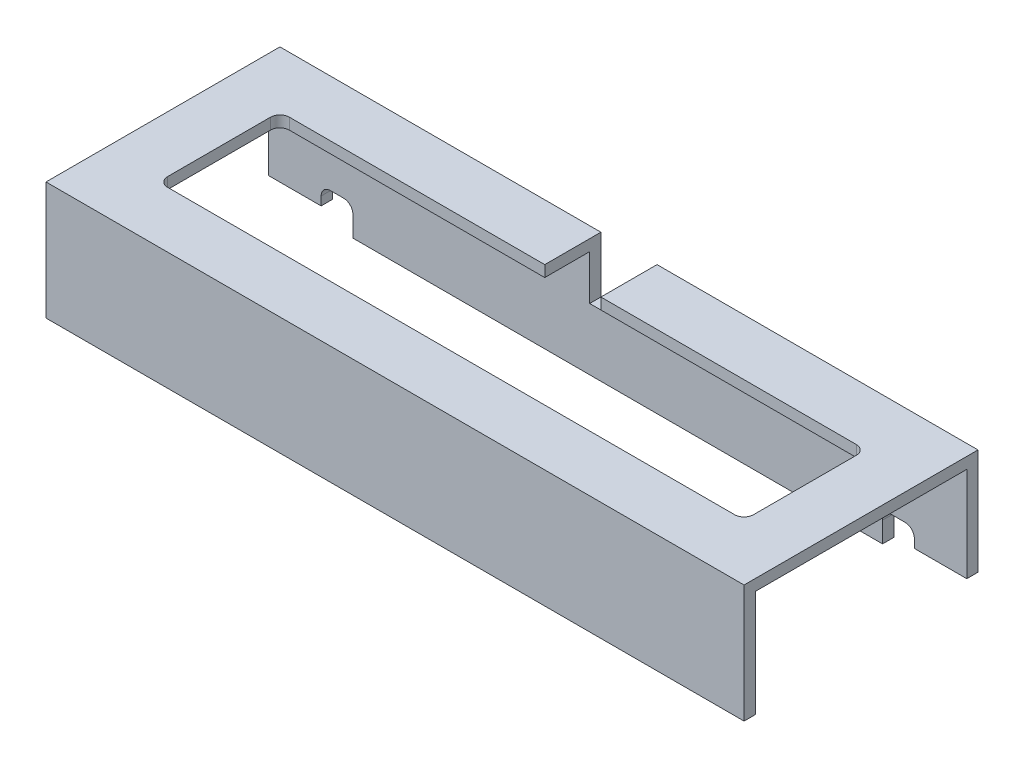
ISO-10303-21;
HEADER;
FILE_DESCRIPTION(('STEP AP214'),'2;1');
FILE_NAME('part.step','',(''),(''),'','','');
FILE_SCHEMA(('AUTOMOTIVE_DESIGN { 1 0 10303 214 1 1 1 1 }'));
ENDSEC;
DATA;
#1=APPLICATION_CONTEXT('core data for automotive mechanical design processes');
#2=APPLICATION_PROTOCOL_DEFINITION('international standard','automotive_design',2000,#1);
#3=PRODUCT_CONTEXT('',#1,'mechanical');
#4=PRODUCT('Part','Part','',(#3));
#5=PRODUCT_RELATED_PRODUCT_CATEGORY('part','',(#4));
#6=PRODUCT_DEFINITION_FORMATION('','',#4);
#7=PRODUCT_DEFINITION_CONTEXT('part definition',#1,'design');
#8=PRODUCT_DEFINITION('design','',#6,#7);
#9=PRODUCT_DEFINITION_SHAPE('','',#8);
#10=(LENGTH_UNIT() NAMED_UNIT(*) SI_UNIT(.MILLI.,.METRE.));
#11=(NAMED_UNIT(*) PLANE_ANGLE_UNIT() SI_UNIT($,.RADIAN.));
#12=(NAMED_UNIT(*) SI_UNIT($,.STERADIAN.) SOLID_ANGLE_UNIT());
#13=UNCERTAINTY_MEASURE_WITH_UNIT(LENGTH_MEASURE(1.E-05),#10,'distance_accuracy_value','');
#14=(GEOMETRIC_REPRESENTATION_CONTEXT(3) GLOBAL_UNCERTAINTY_ASSIGNED_CONTEXT((#13)) GLOBAL_UNIT_ASSIGNED_CONTEXT((#10,
#11,#12)) REPRESENTATION_CONTEXT('',''));
#15=CARTESIAN_POINT('',(0.,0.,0.));
#16=DIRECTION('',(0.,0.,1.));
#17=DIRECTION('',(1.,0.,0.));
#18=AXIS2_PLACEMENT_3D('',#15,#16,#17);
#19=CARTESIAN_POINT('',(451.478569788377,63.,-125.));
#20=DIRECTION('',(0.,-1.,0.));
#21=DIRECTION('',(0.,0.,-1.));
#22=AXIS2_PLACEMENT_3D('',#19,#20,#21);
#23=PLANE('',#22);
#24=DIRECTION('',(1.,0.,0.));
#25=VECTOR('',#24,1.);
#26=CARTESIAN_POINT('',(0.,63.,-95.));
#27=LINE('',#26,#25);
#28=CARTESIAN_POINT('',(139.999999999998,63.,-95.));
#29=VERTEX_POINT('',#28);
#30=CARTESIAN_POINT('',(276.499999999998,63.,-95.));
#31=VERTEX_POINT('',#30);
#32=EDGE_CURVE('E281',#29,#31,#27,.T.);
#33=ORIENTED_EDGE('',*,*,#32,.T.);
#34=CARTESIAN_POINT('',(276.499999999998,63.,-90.));
#35=DIRECTION('',(0.,-1.,0.));
#36=DIRECTION('',(0.,0.,-1.));
#37=AXIS2_PLACEMENT_3D('',#34,#35,#36);
#38=CIRCLE('',#37,5.);
#39=CARTESIAN_POINT('',(281.499999999998,63.,-90.));
#40=VERTEX_POINT('',#39);
#41=EDGE_CURVE('E375',#31,#40,#38,.T.);
#42=ORIENTED_EDGE('',*,*,#41,.T.);
#43=DIRECTION('',(0.,0.,-1.));
#44=VECTOR('',#43,1.);
#45=CARTESIAN_POINT('',(281.499999999998,63.,0.));
#46=LINE('',#45,#44);
#47=CARTESIAN_POINT('',(281.499999999998,63.,-35.));
#48=VERTEX_POINT('',#47);
#49=EDGE_CURVE('E408',#48,#40,#46,.T.);
#50=ORIENTED_EDGE('',*,*,#49,.F.);
#51=CARTESIAN_POINT('',(276.499999999998,63.,-35.));
#52=DIRECTION('',(0.,-1.,0.));
#53=DIRECTION('',(0.,0.,-1.));
#54=AXIS2_PLACEMENT_3D('',#51,#52,#53);
#55=CIRCLE('',#54,5.);
#56=CARTESIAN_POINT('',(276.499999999998,63.,-30.));
#57=VERTEX_POINT('',#56);
#58=EDGE_CURVE('E371',#48,#57,#55,.T.);
#59=ORIENTED_EDGE('',*,*,#58,.T.);
#60=DIRECTION('',(1.,0.,0.));
#61=VECTOR('',#60,1.);
#62=CARTESIAN_POINT('',(0.,63.,-30.));
#63=LINE('',#62,#61);
#64=CARTESIAN_POINT('',(-26.5000000000014,63.,-30.));
#65=VERTEX_POINT('',#64);
#66=EDGE_CURVE('E402',#65,#57,#63,.T.);
#67=ORIENTED_EDGE('',*,*,#66,.F.);
#68=CARTESIAN_POINT('',(-26.5000000000014,63.,-35.));
#69=DIRECTION('',(0.,-1.,0.));
#70=DIRECTION('',(0.,0.,-1.));
#71=AXIS2_PLACEMENT_3D('',#68,#69,#70);
#72=CIRCLE('',#71,5.);
#73=CARTESIAN_POINT('',(-31.5000000000014,63.,-35.));
#74=VERTEX_POINT('',#73);
#75=EDGE_CURVE('E378',#65,#74,#72,.T.);
#76=ORIENTED_EDGE('',*,*,#75,.T.);
#77=DIRECTION('',(0.,0.,1.));
#78=VECTOR('',#77,1.);
#79=CARTESIAN_POINT('',(-31.5000000000014,63.,0.));
#80=LINE('',#79,#78);
#81=CARTESIAN_POINT('',(-31.5000000000014,63.,-90.));
#82=VERTEX_POINT('',#81);
#83=EDGE_CURVE('E401',#82,#74,#80,.T.);
#84=ORIENTED_EDGE('',*,*,#83,.F.);
#85=CARTESIAN_POINT('',(-26.5000000000014,63.,-90.));
#86=DIRECTION('',(0.,-1.,0.));
#87=DIRECTION('',(0.,0.,-1.));
#88=AXIS2_PLACEMENT_3D('',#85,#86,#87);
#89=CIRCLE('',#88,5.);
#90=CARTESIAN_POINT('',(-26.5000000000014,63.,-95.));
#91=VERTEX_POINT('',#90);
#92=EDGE_CURVE('E57',#82,#91,#89,.T.);
#93=ORIENTED_EDGE('',*,*,#92,.T.);
#94=CARTESIAN_POINT('',(109.999999999998,63.,-95.));
#95=VERTEX_POINT('',#94);
#96=EDGE_CURVE('E406',#91,#95,#27,.T.);
#97=ORIENTED_EDGE('',*,*,#96,.T.);
#98=DIRECTION('',(0.,0.,-1.));
#99=VECTOR('',#98,1.);
#100=CARTESIAN_POINT('',(109.999999999998,63.,-95.));
#101=LINE('',#100,#99);
#102=CARTESIAN_POINT('',(109.999999999998,63.,-125.));
#103=VERTEX_POINT('',#102);
#104=EDGE_CURVE('E290',#95,#103,#101,.T.);
#105=ORIENTED_EDGE('',*,*,#104,.T.);
#106=DIRECTION('',(-1.,0.,0.));
#107=VECTOR('',#106,1.);
#108=CARTESIAN_POINT('',(451.478569788377,63.,-125.));
#109=LINE('',#108,#107);
#110=CARTESIAN_POINT('',(-61.5000000000014,63.,-125.));
#111=VERTEX_POINT('',#110);
#112=EDGE_CURVE('E516',#103,#111,#109,.T.);
#113=ORIENTED_EDGE('',*,*,#112,.T.);
#114=DIRECTION('',(0.,0.,-1.));
#115=VECTOR('',#114,1.);
#116=CARTESIAN_POINT('',(-61.5000000000014,63.,-125.));
#117=LINE('',#116,#115);
#118=CARTESIAN_POINT('',(-61.5000000000014,63.,0.));
#119=VERTEX_POINT('',#118);
#120=EDGE_CURVE('E486',#119,#111,#117,.T.);
#121=ORIENTED_EDGE('',*,*,#120,.F.);
#122=DIRECTION('',(-1.,0.,0.));
#123=VECTOR('',#122,1.);
#124=CARTESIAN_POINT('',(451.478569788377,63.,0.));
#125=LINE('',#124,#123);
#126=CARTESIAN_POINT('',(311.499999999998,63.,0.));
#127=VERTEX_POINT('',#126);
#128=EDGE_CURVE('E495',#127,#119,#125,.T.);
#129=ORIENTED_EDGE('',*,*,#128,.F.);
#130=DIRECTION('',(0.,0.,-1.));
#131=VECTOR('',#130,1.);
#132=CARTESIAN_POINT('',(311.499999999998,63.,-125.));
#133=LINE('',#132,#131);
#134=CARTESIAN_POINT('',(311.499999999998,63.,-125.));
#135=VERTEX_POINT('',#134);
#136=EDGE_CURVE('E500',#127,#135,#133,.T.);
#137=ORIENTED_EDGE('',*,*,#136,.T.);
#138=CARTESIAN_POINT('',(139.999999999998,63.,-125.));
#139=VERTEX_POINT('',#138);
#140=EDGE_CURVE('E517',#135,#139,#109,.T.);
#141=ORIENTED_EDGE('',*,*,#140,.T.);
#142=DIRECTION('',(0.,0.,-1.));
#143=VECTOR('',#142,1.);
#144=CARTESIAN_POINT('',(139.999999999998,63.,-95.));
#145=LINE('',#144,#143);
#146=EDGE_CURVE('E432',#29,#139,#145,.T.);
#147=ORIENTED_EDGE('',*,*,#146,.F.);
#148=EDGE_LOOP('',(#33,#42,#50,#59,#67,#76,#84,#93,#97,#105,#113,#121,#129,#137,#141,#147));
#149=FACE_BOUND('',#148,.T.);
#150=ADVANCED_FACE('F49',(#149),#23,.F.);
#151=CARTESIAN_POINT('',(451.478569788377,57.,-6.));
#152=DIRECTION('',(0.,1.,0.));
#153=DIRECTION('',(0.,0.,1.));
#154=AXIS2_PLACEMENT_3D('',#151,#152,#153);
#155=PLANE('',#154);
#156=DIRECTION('',(-1.,0.,0.));
#157=VECTOR('',#156,1.);
#158=CARTESIAN_POINT('',(0.,57.,-95.));
#159=LINE('',#158,#157);
#160=CARTESIAN_POINT('',(109.999999999998,57.,-95.));
#161=VERTEX_POINT('',#160);
#162=CARTESIAN_POINT('',(-26.5000000000014,57.,-95.));
#163=VERTEX_POINT('',#162);
#164=EDGE_CURVE('E282',#161,#163,#159,.T.);
#165=ORIENTED_EDGE('',*,*,#164,.T.);
#166=CARTESIAN_POINT('',(-26.5000000000014,57.,-90.));
#167=DIRECTION('',(0.,1.,0.));
#168=DIRECTION('',(0.,0.,1.));
#169=AXIS2_PLACEMENT_3D('',#166,#167,#168);
#170=CIRCLE('',#169,5.);
#171=CARTESIAN_POINT('',(-31.5000000000014,57.,-90.));
#172=VERTEX_POINT('',#171);
#173=EDGE_CURVE('E13',#163,#172,#170,.T.);
#174=ORIENTED_EDGE('',*,*,#173,.T.);
#175=DIRECTION('',(0.,0.,-1.));
#176=VECTOR('',#175,1.);
#177=CARTESIAN_POINT('',(-31.5000000000014,57.,0.));
#178=LINE('',#177,#176);
#179=CARTESIAN_POINT('',(-31.5000000000014,57.,-35.));
#180=VERTEX_POINT('',#179);
#181=EDGE_CURVE('E388',#180,#172,#178,.T.);
#182=ORIENTED_EDGE('',*,*,#181,.F.);
#183=CARTESIAN_POINT('',(-26.5000000000014,57.,-35.));
#184=DIRECTION('',(0.,1.,0.));
#185=DIRECTION('',(0.,0.,1.));
#186=AXIS2_PLACEMENT_3D('',#183,#184,#185);
#187=CIRCLE('',#186,5.);
#188=CARTESIAN_POINT('',(-26.5000000000014,57.,-30.));
#189=VERTEX_POINT('',#188);
#190=EDGE_CURVE('E380',#180,#189,#187,.T.);
#191=ORIENTED_EDGE('',*,*,#190,.T.);
#192=DIRECTION('',(-1.,0.,0.));
#193=VECTOR('',#192,1.);
#194=CARTESIAN_POINT('',(0.,57.,-30.));
#195=LINE('',#194,#193);
#196=CARTESIAN_POINT('',(276.499999999998,57.,-30.));
#197=VERTEX_POINT('',#196);
#198=EDGE_CURVE('E385',#197,#189,#195,.T.);
#199=ORIENTED_EDGE('',*,*,#198,.F.);
#200=CARTESIAN_POINT('',(276.499999999998,57.,-35.));
#201=DIRECTION('',(0.,1.,0.));
#202=DIRECTION('',(0.,0.,1.));
#203=AXIS2_PLACEMENT_3D('',#200,#201,#202);
#204=CIRCLE('',#203,5.);
#205=CARTESIAN_POINT('',(281.499999999998,57.,-35.));
#206=VERTEX_POINT('',#205);
#207=EDGE_CURVE('E373',#197,#206,#204,.T.);
#208=ORIENTED_EDGE('',*,*,#207,.T.);
#209=DIRECTION('',(0.,0.,1.));
#210=VECTOR('',#209,1.);
#211=CARTESIAN_POINT('',(281.499999999998,57.,0.));
#212=LINE('',#211,#210);
#213=CARTESIAN_POINT('',(281.499999999998,57.,-90.));
#214=VERTEX_POINT('',#213);
#215=EDGE_CURVE('E397',#214,#206,#212,.T.);
#216=ORIENTED_EDGE('',*,*,#215,.F.);
#217=CARTESIAN_POINT('',(276.499999999998,57.,-90.));
#218=DIRECTION('',(0.,1.,0.));
#219=DIRECTION('',(0.,0.,1.));
#220=AXIS2_PLACEMENT_3D('',#217,#218,#219);
#221=CIRCLE('',#220,5.);
#222=CARTESIAN_POINT('',(276.499999999998,57.,-95.));
#223=VERTEX_POINT('',#222);
#224=EDGE_CURVE('E277',#214,#223,#221,.T.);
#225=ORIENTED_EDGE('',*,*,#224,.T.);
#226=CARTESIAN_POINT('',(139.999999999998,57.,-95.));
#227=VERTEX_POINT('',#226);
#228=EDGE_CURVE('E268',#223,#227,#159,.T.);
#229=ORIENTED_EDGE('',*,*,#228,.T.);
#230=DIRECTION('',(0.,0.,1.));
#231=VECTOR('',#230,1.);
#232=CARTESIAN_POINT('',(139.999999999998,57.,-6.));
#233=LINE('',#232,#231);
#234=CARTESIAN_POINT('',(139.999999999998,57.,-119.));
#235=VERTEX_POINT('',#234);
#236=EDGE_CURVE('E273',#235,#227,#233,.T.);
#237=ORIENTED_EDGE('',*,*,#236,.F.);
#238=DIRECTION('',(-1.,0.,0.));
#239=VECTOR('',#238,1.);
#240=CARTESIAN_POINT('',(451.478569788377,57.,-119.));
#241=LINE('',#240,#239);
#242=CARTESIAN_POINT('',(311.499999999998,57.,-119.));
#243=VERTEX_POINT('',#242);
#244=EDGE_CURVE('E527',#243,#235,#241,.T.);
#245=ORIENTED_EDGE('',*,*,#244,.F.);
#246=DIRECTION('',(0.,0.,1.));
#247=VECTOR('',#246,1.);
#248=CARTESIAN_POINT('',(311.499999999998,57.,-6.00000000000004));
#249=LINE('',#248,#247);
#250=CARTESIAN_POINT('',(311.499999999998,57.,-6.));
#251=VERTEX_POINT('',#250);
#252=EDGE_CURVE('E502',#243,#251,#249,.T.);
#253=ORIENTED_EDGE('',*,*,#252,.T.);
#254=DIRECTION('',(-1.,0.,0.));
#255=VECTOR('',#254,1.);
#256=CARTESIAN_POINT('',(451.478569788377,57.,-6.));
#257=LINE('',#256,#255);
#258=CARTESIAN_POINT('',(-61.5000000000014,57.,-6.));
#259=VERTEX_POINT('',#258);
#260=EDGE_CURVE('E529',#251,#259,#257,.T.);
#261=ORIENTED_EDGE('',*,*,#260,.T.);
#262=DIRECTION('',(0.,0.,1.));
#263=VECTOR('',#262,1.);
#264=CARTESIAN_POINT('',(-61.5000000000014,57.,-5.99999999999994));
#265=LINE('',#264,#263);
#266=CARTESIAN_POINT('',(-61.5000000000014,57.,-119.));
#267=VERTEX_POINT('',#266);
#268=EDGE_CURVE('E477',#267,#259,#265,.T.);
#269=ORIENTED_EDGE('',*,*,#268,.F.);
#270=CARTESIAN_POINT('',(109.999999999998,57.,-119.));
#271=VERTEX_POINT('',#270);
#272=EDGE_CURVE('E526',#271,#267,#241,.T.);
#273=ORIENTED_EDGE('',*,*,#272,.F.);
#274=DIRECTION('',(0.,0.,1.));
#275=VECTOR('',#274,1.);
#276=CARTESIAN_POINT('',(109.999999999998,57.,-6.));
#277=LINE('',#276,#275);
#278=EDGE_CURVE('E297',#271,#161,#277,.T.);
#279=ORIENTED_EDGE('',*,*,#278,.T.);
#280=EDGE_LOOP('',(#165,#174,#182,#191,#199,#208,#216,#225,#229,#237,#245,#253,#261,#269,#273,#279));
#281=FACE_BOUND('',#280,.T.);
#282=ADVANCED_FACE('F270',(#281),#155,.F.);
#283=CARTESIAN_POINT('',(451.478569788377,0.,-125.));
#284=DIRECTION('',(0.,0.,1.));
#285=DIRECTION('',(0.,-1.,0.));
#286=AXIS2_PLACEMENT_3D('',#283,#284,#285);
#287=PLANE('',#286);
#288=ORIENTED_EDGE('',*,*,#112,.F.);
#289=DIRECTION('',(0.,1.,0.));
#290=VECTOR('',#289,1.);
#291=CARTESIAN_POINT('',(109.999999999998,0.,-125.));
#292=LINE('',#291,#290);
#293=CARTESIAN_POINT('',(109.999999999998,33.,-125.));
#294=VERTEX_POINT('',#293);
#295=EDGE_CURVE('E419',#294,#103,#292,.T.);
#296=ORIENTED_EDGE('',*,*,#295,.F.);
#297=DIRECTION('',(1.,0.,0.));
#298=VECTOR('',#297,1.);
#299=CARTESIAN_POINT('',(0.,33.0000000000001,-125.));
#300=LINE('',#299,#298);
#301=CARTESIAN_POINT('',(139.999999999998,33.,-125.));
#302=VERTEX_POINT('',#301);
#303=EDGE_CURVE('E417',#294,#302,#300,.T.);
#304=ORIENTED_EDGE('',*,*,#303,.T.);
#305=DIRECTION('',(0.,1.,0.));
#306=VECTOR('',#305,1.);
#307=CARTESIAN_POINT('',(139.999999999998,0.,-125.));
#308=LINE('',#307,#306);
#309=EDGE_CURVE('E421',#302,#139,#308,.T.);
#310=ORIENTED_EDGE('',*,*,#309,.T.);
#311=ORIENTED_EDGE('',*,*,#140,.F.);
#312=DIRECTION('',(0.,-1.,0.));
#313=VECTOR('',#312,1.);
#314=CARTESIAN_POINT('',(311.499999999998,0.,-125.));
#315=LINE('',#314,#313);
#316=CARTESIAN_POINT('',(311.499999999998,6.3999999999958,-125.));
#317=VERTEX_POINT('',#316);
#318=EDGE_CURVE('E496',#135,#317,#315,.T.);
#319=ORIENTED_EDGE('',*,*,#318,.T.);
#320=DIRECTION('',(1.,0.,0.));
#321=VECTOR('',#320,1.);
#322=CARTESIAN_POINT('',(-4.55984456540696E-13,6.3999999999751,-125.));
#323=LINE('',#322,#321);
#324=CARTESIAN_POINT('',(283.499999999998,6.3999999999953,-125.));
#325=VERTEX_POINT('',#324);
#326=EDGE_CURVE('E459',#325,#317,#323,.T.);
#327=ORIENTED_EDGE('',*,*,#326,.F.);
#328=DIRECTION('',(0.,1.,0.));
#329=VECTOR('',#328,1.);
#330=CARTESIAN_POINT('',(283.499999999998,0.,-125.));
#331=LINE('',#330,#329);
#332=CARTESIAN_POINT('',(283.499999999998,11.0000000000001,-125.));
#333=VERTEX_POINT('',#332);
#334=EDGE_CURVE('E456',#325,#333,#331,.T.);
#335=ORIENTED_EDGE('',*,*,#334,.T.);
#336=CARTESIAN_POINT('',(278.499999999998,11.0000000000001,-125.));
#337=DIRECTION('',(0.,0.,1.));
#338=DIRECTION('',(0.,-1.,0.));
#339=AXIS2_PLACEMENT_3D('',#336,#337,#338);
#340=CIRCLE('',#339,5.);
#341=CARTESIAN_POINT('',(278.499999999998,16.0000000000001,-125.));
#342=VERTEX_POINT('',#341);
#343=EDGE_CURVE('E367',#333,#342,#340,.T.);
#344=ORIENTED_EDGE('',*,*,#343,.T.);
#345=DIRECTION('',(1.,0.,0.));
#346=VECTOR('',#345,1.);
#347=CARTESIAN_POINT('',(0.,16.0000000000002,-125.));
#348=LINE('',#347,#346);
#349=CARTESIAN_POINT('',(271.499999999998,16.0000000000001,-125.));
#350=VERTEX_POINT('',#349);
#351=EDGE_CURVE('E464',#350,#342,#348,.T.);
#352=ORIENTED_EDGE('',*,*,#351,.F.);
#353=CARTESIAN_POINT('',(271.499999999998,11.0000000000001,-125.));
#354=DIRECTION('',(0.,0.,1.));
#355=DIRECTION('',(0.,-1.,0.));
#356=AXIS2_PLACEMENT_3D('',#353,#354,#355);
#357=CIRCLE('',#356,5.);
#358=CARTESIAN_POINT('',(266.499999999998,11.0000000000001,-125.));
#359=VERTEX_POINT('',#358);
#360=EDGE_CURVE('E363',#350,#359,#357,.T.);
#361=ORIENTED_EDGE('',*,*,#360,.T.);
#362=DIRECTION('',(0.,1.,0.));
#363=VECTOR('',#362,1.);
#364=CARTESIAN_POINT('',(266.499999999998,0.,-125.));
#365=LINE('',#364,#363);
#366=CARTESIAN_POINT('',(266.499999999998,0.,-125.));
#367=VERTEX_POINT('',#366);
#368=EDGE_CURVE('E461',#367,#359,#365,.T.);
#369=ORIENTED_EDGE('',*,*,#368,.F.);
#370=DIRECTION('',(-1.,0.,0.));
#371=VECTOR('',#370,1.);
#372=CARTESIAN_POINT('',(451.478569788377,0.,-125.));
#373=LINE('',#372,#371);
#374=CARTESIAN_POINT('',(-16.5000000000013,0.,-125.));
#375=VERTEX_POINT('',#374);
#376=EDGE_CURVE('E520',#367,#375,#373,.T.);
#377=ORIENTED_EDGE('',*,*,#376,.T.);
#378=DIRECTION('',(0.,1.,0.));
#379=VECTOR('',#378,1.);
#380=CARTESIAN_POINT('',(-16.5000000000013,0.,-125.));
#381=LINE('',#380,#379);
#382=CARTESIAN_POINT('',(-16.5000000000013,11.0000000000001,-125.));
#383=VERTEX_POINT('',#382);
#384=EDGE_CURVE('E444',#375,#383,#381,.T.);
#385=ORIENTED_EDGE('',*,*,#384,.T.);
#386=CARTESIAN_POINT('',(-21.5000000000013,11.0000000000001,-125.));
#387=DIRECTION('',(0.,0.,1.));
#388=DIRECTION('',(0.,-1.,0.));
#389=AXIS2_PLACEMENT_3D('',#386,#387,#388);
#390=CIRCLE('',#389,5.);
#391=CARTESIAN_POINT('',(-21.5000000000013,16.0000000000001,-125.));
#392=VERTEX_POINT('',#391);
#393=EDGE_CURVE('E359',#383,#392,#390,.T.);
#394=ORIENTED_EDGE('',*,*,#393,.T.);
#395=DIRECTION('',(-1.,0.,0.));
#396=VECTOR('',#395,1.);
#397=CARTESIAN_POINT('',(0.,16.0000000000001,-125.));
#398=LINE('',#397,#396);
#399=CARTESIAN_POINT('',(-28.5000000000013,16.0000000000001,-125.));
#400=VERTEX_POINT('',#399);
#401=EDGE_CURVE('E441',#392,#400,#398,.T.);
#402=ORIENTED_EDGE('',*,*,#401,.T.);
#403=CARTESIAN_POINT('',(-28.5000000000013,11.0000000000001,-125.));
#404=DIRECTION('',(0.,0.,1.));
#405=DIRECTION('',(0.,-1.,0.));
#406=AXIS2_PLACEMENT_3D('',#403,#404,#405);
#407=CIRCLE('',#406,5.);
#408=CARTESIAN_POINT('',(-33.5000000000013,11.0000000000001,-125.));
#409=VERTEX_POINT('',#408);
#410=EDGE_CURVE('E355',#400,#409,#407,.T.);
#411=ORIENTED_EDGE('',*,*,#410,.T.);
#412=DIRECTION('',(0.,1.,0.));
#413=VECTOR('',#412,1.);
#414=CARTESIAN_POINT('',(-33.5000000000013,0.,-125.));
#415=LINE('',#414,#413);
#416=CARTESIAN_POINT('',(-33.5000000000013,6.3999999999953,-125.));
#417=VERTEX_POINT('',#416);
#418=EDGE_CURVE('E438',#417,#409,#415,.T.);
#419=ORIENTED_EDGE('',*,*,#418,.F.);
#420=DIRECTION('',(-1.,0.,0.));
#421=VECTOR('',#420,1.);
#422=CARTESIAN_POINT('',(4.18316175349381E-13,6.39999999999311,-125.));
#423=LINE('',#422,#421);
#424=CARTESIAN_POINT('',(-61.5000000000014,6.39999999999621,-125.));
#425=VERTEX_POINT('',#424);
#426=EDGE_CURVE('E415',#417,#425,#423,.T.);
#427=ORIENTED_EDGE('',*,*,#426,.T.);
#428=DIRECTION('',(0.,-1.,0.));
#429=VECTOR('',#428,1.);
#430=CARTESIAN_POINT('',(-61.5000000000014,0.,-125.));
#431=LINE('',#430,#429);
#432=EDGE_CURVE('E483',#111,#425,#431,.T.);
#433=ORIENTED_EDGE('',*,*,#432,.F.);
#434=EDGE_LOOP('',(#288,#296,#304,#310,#311,#319,#327,#335,#344,#352,#361,#369,#377,#385,#394,
#402,#411,#419,#427,#433));
#435=FACE_BOUND('',#434,.T.);
#436=ADVANCED_FACE('F564',(#435),#287,.F.);
#437=CARTESIAN_POINT('',(451.478569788377,0.,-119.));
#438=DIRECTION('',(0.,1.,0.));
#439=DIRECTION('',(0.,0.,1.));
#440=AXIS2_PLACEMENT_3D('',#437,#438,#439);
#441=PLANE('',#440);
#442=DIRECTION('',(0.,0.,-1.));
#443=VECTOR('',#442,1.);
#444=CARTESIAN_POINT('',(-16.5000000000013,0.,-95.));
#445=LINE('',#444,#443);
#446=CARTESIAN_POINT('',(-16.5000000000013,0.,-119.));
#447=VERTEX_POINT('',#446);
#448=EDGE_CURVE('E422',#447,#375,#445,.T.);
#449=ORIENTED_EDGE('',*,*,#448,.T.);
#450=ORIENTED_EDGE('',*,*,#376,.F.);
#451=DIRECTION('',(0.,0.,-1.));
#452=VECTOR('',#451,1.);
#453=CARTESIAN_POINT('',(266.499999999998,0.,-95.));
#454=LINE('',#453,#452);
#455=CARTESIAN_POINT('',(266.499999999998,0.,-119.));
#456=VERTEX_POINT('',#455);
#457=EDGE_CURVE('E468',#456,#367,#454,.T.);
#458=ORIENTED_EDGE('',*,*,#457,.F.);
#459=DIRECTION('',(-1.,0.,0.));
#460=VECTOR('',#459,1.);
#461=CARTESIAN_POINT('',(451.478569788377,0.,-119.));
#462=LINE('',#461,#460);
#463=EDGE_CURVE('E523',#456,#447,#462,.T.);
#464=ORIENTED_EDGE('',*,*,#463,.T.);
#465=EDGE_LOOP('',(#449,#450,#458,#464));
#466=FACE_BOUND('',#465,.T.);
#467=ADVANCED_FACE('F630',(#466),#441,.F.);
#468=CARTESIAN_POINT('',(451.478569788377,57.,-119.));
#469=DIRECTION('',(0.,0.,-1.));
#470=DIRECTION('',(-1.,0.,0.));
#471=AXIS2_PLACEMENT_3D('',#468,#469,#470);
#472=PLANE('',#471);
#473=DIRECTION('',(1.,0.,0.));
#474=VECTOR('',#473,1.);
#475=CARTESIAN_POINT('',(451.478569788377,33.,-119.));
#476=LINE('',#475,#474);
#477=CARTESIAN_POINT('',(109.999999999998,33.,-119.));
#478=VERTEX_POINT('',#477);
#479=CARTESIAN_POINT('',(139.999999999998,33.,-119.));
#480=VERTEX_POINT('',#479);
#481=EDGE_CURVE('E315',#478,#480,#476,.T.);
#482=ORIENTED_EDGE('',*,*,#481,.F.);
#483=DIRECTION('',(0.,1.,0.));
#484=VECTOR('',#483,1.);
#485=CARTESIAN_POINT('',(109.999999999998,57.,-119.));
#486=LINE('',#485,#484);
#487=EDGE_CURVE('E453',#478,#271,#486,.T.);
#488=ORIENTED_EDGE('',*,*,#487,.T.);
#489=ORIENTED_EDGE('',*,*,#272,.T.);
#490=DIRECTION('',(0.,1.,0.));
#491=VECTOR('',#490,1.);
#492=CARTESIAN_POINT('',(-61.5000000000014,57.,-119.));
#493=LINE('',#492,#491);
#494=CARTESIAN_POINT('',(-61.5000000000014,6.39999999999712,-119.));
#495=VERTEX_POINT('',#494);
#496=EDGE_CURVE('E480',#495,#267,#493,.T.);
#497=ORIENTED_EDGE('',*,*,#496,.F.);
#498=DIRECTION('',(-1.,0.,0.));
#499=VECTOR('',#498,1.);
#500=CARTESIAN_POINT('',(451.478569788373,6.39999999996359,-119.));
#501=LINE('',#500,#499);
#502=CARTESIAN_POINT('',(-33.5000000000013,6.39999999999529,-119.));
#503=VERTEX_POINT('',#502);
#504=EDGE_CURVE('E429',#503,#495,#501,.T.);
#505=ORIENTED_EDGE('',*,*,#504,.F.);
#506=DIRECTION('',(0.,1.,0.));
#507=VECTOR('',#506,1.);
#508=CARTESIAN_POINT('',(-33.5000000000013,57.,-119.));
#509=LINE('',#508,#507);
#510=CARTESIAN_POINT('',(-33.5000000000013,11.0000000000001,-119.));
#511=VERTEX_POINT('',#510);
#512=EDGE_CURVE('E301',#503,#511,#509,.T.);
#513=ORIENTED_EDGE('',*,*,#512,.T.);
#514=CARTESIAN_POINT('',(-28.5000000000013,11.0000000000001,-119.));
#515=DIRECTION('',(0.,0.,-1.));
#516=DIRECTION('',(-1.,0.,0.));
#517=AXIS2_PLACEMENT_3D('',#514,#515,#516);
#518=CIRCLE('',#517,5.);
#519=CARTESIAN_POINT('',(-28.5000000000013,16.0000000000001,-119.));
#520=VERTEX_POINT('',#519);
#521=EDGE_CURVE('E357',#511,#520,#518,.T.);
#522=ORIENTED_EDGE('',*,*,#521,.T.);
#523=DIRECTION('',(-1.,0.,0.));
#524=VECTOR('',#523,1.);
#525=CARTESIAN_POINT('',(451.478569788377,16.0000000000002,-119.));
#526=LINE('',#525,#524);
#527=CARTESIAN_POINT('',(-21.5000000000014,16.0000000000001,-119.));
#528=VERTEX_POINT('',#527);
#529=EDGE_CURVE('E309',#528,#520,#526,.T.);
#530=ORIENTED_EDGE('',*,*,#529,.F.);
#531=CARTESIAN_POINT('',(-21.5000000000013,11.0000000000001,-119.));
#532=DIRECTION('',(0.,0.,-1.));
#533=DIRECTION('',(-1.,0.,0.));
#534=AXIS2_PLACEMENT_3D('',#531,#532,#533);
#535=CIRCLE('',#534,5.);
#536=CARTESIAN_POINT('',(-16.5000000000013,11.0000000000001,-119.));
#537=VERTEX_POINT('',#536);
#538=EDGE_CURVE('E361',#528,#537,#535,.T.);
#539=ORIENTED_EDGE('',*,*,#538,.T.);
#540=DIRECTION('',(0.,1.,0.));
#541=VECTOR('',#540,1.);
#542=CARTESIAN_POINT('',(-16.5000000000013,57.,-119.));
#543=LINE('',#542,#541);
#544=EDGE_CURVE('E312',#447,#537,#543,.T.);
#545=ORIENTED_EDGE('',*,*,#544,.F.);
#546=ORIENTED_EDGE('',*,*,#463,.F.);
#547=DIRECTION('',(0.,1.,0.));
#548=VECTOR('',#547,1.);
#549=CARTESIAN_POINT('',(266.499999999998,57.,-119.));
#550=LINE('',#549,#548);
#551=CARTESIAN_POINT('',(266.499999999998,11.0000000000001,-119.));
#552=VERTEX_POINT('',#551);
#553=EDGE_CURVE('E303',#456,#552,#550,.T.);
#554=ORIENTED_EDGE('',*,*,#553,.T.);
#555=CARTESIAN_POINT('',(271.499999999998,11.0000000000001,-119.));
#556=DIRECTION('',(0.,0.,-1.));
#557=DIRECTION('',(-1.,0.,0.));
#558=AXIS2_PLACEMENT_3D('',#555,#556,#557);
#559=CIRCLE('',#558,5.);
#560=CARTESIAN_POINT('',(271.499999999998,16.0000000000001,-119.));
#561=VERTEX_POINT('',#560);
#562=EDGE_CURVE('E365',#552,#561,#559,.T.);
#563=ORIENTED_EDGE('',*,*,#562,.T.);
#564=DIRECTION('',(1.,0.,0.));
#565=VECTOR('',#564,1.);
#566=CARTESIAN_POINT('',(451.478569788377,16.0000000000001,-119.));
#567=LINE('',#566,#565);
#568=CARTESIAN_POINT('',(278.499999999998,16.0000000000001,-119.));
#569=VERTEX_POINT('',#568);
#570=EDGE_CURVE('E542',#561,#569,#567,.T.);
#571=ORIENTED_EDGE('',*,*,#570,.T.);
#572=CARTESIAN_POINT('',(278.499999999998,11.0000000000001,-119.));
#573=DIRECTION('',(0.,0.,-1.));
#574=DIRECTION('',(-1.,0.,0.));
#575=AXIS2_PLACEMENT_3D('',#572,#573,#574);
#576=CIRCLE('',#575,5.);
#577=CARTESIAN_POINT('',(283.499999999998,11.0000000000001,-119.));
#578=VERTEX_POINT('',#577);
#579=EDGE_CURVE('E369',#569,#578,#576,.T.);
#580=ORIENTED_EDGE('',*,*,#579,.T.);
#581=DIRECTION('',(0.,1.,0.));
#582=VECTOR('',#581,1.);
#583=CARTESIAN_POINT('',(283.499999999998,57.,-119.));
#584=LINE('',#583,#582);
#585=CARTESIAN_POINT('',(283.499999999998,6.39999999999529,-119.));
#586=VERTEX_POINT('',#585);
#587=EDGE_CURVE('E539',#586,#578,#584,.T.);
#588=ORIENTED_EDGE('',*,*,#587,.F.);
#589=DIRECTION('',(1.,0.,0.));
#590=VECTOR('',#589,1.);
#591=CARTESIAN_POINT('',(451.47856978838,6.40000000000727,-119.));
#592=LINE('',#591,#590);
#593=CARTESIAN_POINT('',(311.499999999998,6.39999999999629,-119.));
#594=VERTEX_POINT('',#593);
#595=EDGE_CURVE('E470',#586,#594,#592,.T.);
#596=ORIENTED_EDGE('',*,*,#595,.T.);
#597=DIRECTION('',(0.,1.,0.));
#598=VECTOR('',#597,1.);
#599=CARTESIAN_POINT('',(311.499999999998,57.,-119.));
#600=LINE('',#599,#598);
#601=EDGE_CURVE('E499',#594,#243,#600,.T.);
#602=ORIENTED_EDGE('',*,*,#601,.T.);
#603=ORIENTED_EDGE('',*,*,#244,.T.);
#604=DIRECTION('',(0.,1.,0.));
#605=VECTOR('',#604,1.);
#606=CARTESIAN_POINT('',(139.999999999998,57.,-119.));
#607=LINE('',#606,#605);
#608=EDGE_CURVE('E296',#480,#235,#607,.T.);
#609=ORIENTED_EDGE('',*,*,#608,.F.);
#610=EDGE_LOOP('',(#482,#488,#489,#497,#505,#513,#522,#530,#539,#545,#546,#554,#563,#571,#580,
#588,#596,#602,#603,#609));
#611=FACE_BOUND('',#610,.T.);
#612=ADVANCED_FACE('F549',(#611),#472,.F.);
#613=CARTESIAN_POINT('',(-61.5000000000014,6.3999999999974,-124.999999999999));
#614=DIRECTION('',(1.,0.,0.));
#615=DIRECTION('',(0.,0.,-1.));
#616=AXIS2_PLACEMENT_3D('',#613,#614,#615);
#617=PLANE('',#616);
#618=DIRECTION('',(0.,0.,-1.));
#619=VECTOR('',#618,1.);
#620=CARTESIAN_POINT('',(-61.5000000000014,6.39999999999713,-124.999999999999));
#621=LINE('',#620,#619);
#622=EDGE_CURVE('E298',#495,#425,#621,.T.);
#623=ORIENTED_EDGE('',*,*,#622,.F.);
#624=ORIENTED_EDGE('',*,*,#496,.T.);
#625=ORIENTED_EDGE('',*,*,#268,.T.);
#626=DIRECTION('',(0.,-1.,0.));
#627=VECTOR('',#626,1.);
#628=CARTESIAN_POINT('',(-61.5000000000014,0.,-6.));
#629=LINE('',#628,#627);
#630=CARTESIAN_POINT('',(-61.5000000000014,0.,-6.));
#631=VERTEX_POINT('',#630);
#632=EDGE_CURVE('E474',#259,#631,#629,.T.);
#633=ORIENTED_EDGE('',*,*,#632,.T.);
#634=DIRECTION('',(0.,0.,1.));
#635=VECTOR('',#634,1.);
#636=CARTESIAN_POINT('',(-61.5000000000014,0.,0.));
#637=LINE('',#636,#635);
#638=CARTESIAN_POINT('',(-61.5000000000014,0.,0.));
#639=VERTEX_POINT('',#638);
#640=EDGE_CURVE('E492',#631,#639,#637,.T.);
#641=ORIENTED_EDGE('',*,*,#640,.T.);
#642=DIRECTION('',(0.,1.,0.));
#643=VECTOR('',#642,1.);
#644=CARTESIAN_POINT('',(-61.5000000000014,63.,0.));
#645=LINE('',#644,#643);
#646=EDGE_CURVE('E489',#639,#119,#645,.T.);
#647=ORIENTED_EDGE('',*,*,#646,.T.);
#648=ORIENTED_EDGE('',*,*,#120,.T.);
#649=ORIENTED_EDGE('',*,*,#432,.T.);
#650=EDGE_LOOP('',(#623,#624,#625,#633,#641,#647,#648,#649));
#651=FACE_BOUND('',#650,.T.);
#652=ADVANCED_FACE('F603',(#651),#617,.F.);
#653=CARTESIAN_POINT('',(451.478569788377,0.,-6.));
#654=DIRECTION('',(0.,0.,1.));
#655=DIRECTION('',(1.,0.,0.));
#656=AXIS2_PLACEMENT_3D('',#653,#654,#655);
#657=PLANE('',#656);
#658=ORIENTED_EDGE('',*,*,#260,.F.);
#659=DIRECTION('',(0.,-1.,0.));
#660=VECTOR('',#659,1.);
#661=CARTESIAN_POINT('',(311.499999999998,0.,-6.));
#662=LINE('',#661,#660);
#663=CARTESIAN_POINT('',(311.499999999998,0.,-6.));
#664=VERTEX_POINT('',#663);
#665=EDGE_CURVE('E505',#251,#664,#662,.T.);
#666=ORIENTED_EDGE('',*,*,#665,.T.);
#667=DIRECTION('',(-1.,0.,0.));
#668=VECTOR('',#667,1.);
#669=CARTESIAN_POINT('',(451.478569788377,0.,-6.));
#670=LINE('',#669,#668);
#671=EDGE_CURVE('E531',#664,#631,#670,.T.);
#672=ORIENTED_EDGE('',*,*,#671,.T.);
#673=ORIENTED_EDGE('',*,*,#632,.F.);
#674=EDGE_LOOP('',(#658,#666,#672,#673));
#675=FACE_BOUND('',#674,.T.);
#676=ADVANCED_FACE('F656',(#675),#657,.F.);
#677=CARTESIAN_POINT('',(451.478569788377,0.,0.));
#678=DIRECTION('',(0.,1.,0.));
#679=DIRECTION('',(0.,0.,1.));
#680=AXIS2_PLACEMENT_3D('',#677,#678,#679);
#681=PLANE('',#680);
#682=ORIENTED_EDGE('',*,*,#671,.F.);
#683=DIRECTION('',(0.,0.,1.));
#684=VECTOR('',#683,1.);
#685=CARTESIAN_POINT('',(311.499999999998,0.,0.));
#686=LINE('',#685,#684);
#687=CARTESIAN_POINT('',(311.499999999998,0.,0.));
#688=VERTEX_POINT('',#687);
#689=EDGE_CURVE('E508',#664,#688,#686,.T.);
#690=ORIENTED_EDGE('',*,*,#689,.T.);
#691=DIRECTION('',(-1.,0.,0.));
#692=VECTOR('',#691,1.);
#693=CARTESIAN_POINT('',(451.478569788377,0.,0.));
#694=LINE('',#693,#692);
#695=EDGE_CURVE('E533',#688,#639,#694,.T.);
#696=ORIENTED_EDGE('',*,*,#695,.T.);
#697=ORIENTED_EDGE('',*,*,#640,.F.);
#698=EDGE_LOOP('',(#682,#690,#696,#697));
#699=FACE_BOUND('',#698,.T.);
#700=ADVANCED_FACE('F659',(#699),#681,.F.);
#701=CARTESIAN_POINT('',(451.478569788377,63.,0.));
#702=DIRECTION('',(0.,0.,-1.));
#703=DIRECTION('',(0.,1.,0.));
#704=AXIS2_PLACEMENT_3D('',#701,#702,#703);
#705=PLANE('',#704);
#706=ORIENTED_EDGE('',*,*,#695,.F.);
#707=DIRECTION('',(0.,1.,0.));
#708=VECTOR('',#707,1.);
#709=CARTESIAN_POINT('',(311.499999999998,63.,0.));
#710=LINE('',#709,#708);
#711=EDGE_CURVE('E511',#688,#127,#710,.T.);
#712=ORIENTED_EDGE('',*,*,#711,.T.);
#713=ORIENTED_EDGE('',*,*,#128,.T.);
#714=ORIENTED_EDGE('',*,*,#646,.F.);
#715=EDGE_LOOP('',(#706,#712,#713,#714));
#716=FACE_BOUND('',#715,.T.);
#717=ADVANCED_FACE('F663',(#716),#705,.F.);
#718=CARTESIAN_POINT('',(311.499999999998,-7.60000000000271,-124.999999999999));
#719=DIRECTION('',(-1.,0.,0.));
#720=DIRECTION('',(0.,0.,-1.));
#721=AXIS2_PLACEMENT_3D('',#718,#719,#720);
#722=PLANE('',#721);
#723=ORIENTED_EDGE('',*,*,#601,.F.);
#724=DIRECTION('',(0.,0.,-1.));
#725=VECTOR('',#724,1.);
#726=CARTESIAN_POINT('',(311.499999999998,6.39999999999729,-124.999999999999));
#727=LINE('',#726,#725);
#728=EDGE_CURVE('E514',#594,#317,#727,.T.);
#729=ORIENTED_EDGE('',*,*,#728,.T.);
#730=ORIENTED_EDGE('',*,*,#318,.F.);
#731=ORIENTED_EDGE('',*,*,#136,.F.);
#732=ORIENTED_EDGE('',*,*,#711,.F.);
#733=ORIENTED_EDGE('',*,*,#689,.F.);
#734=ORIENTED_EDGE('',*,*,#665,.F.);
#735=ORIENTED_EDGE('',*,*,#252,.F.);
#736=EDGE_LOOP('',(#723,#729,#730,#731,#732,#733,#734,#735));
#737=FACE_BOUND('',#736,.T.);
#738=ADVANCED_FACE('F580',(#737),#722,.F.);
#739=CARTESIAN_POINT('',(283.499999999998,0.,-95.));
#740=DIRECTION('',(-1.,0.,0.));
#741=DIRECTION('',(0.,0.,1.));
#742=AXIS2_PLACEMENT_3D('',#739,#740,#741);
#743=PLANE('',#742);
#744=ORIENTED_EDGE('',*,*,#587,.T.);
#745=DIRECTION('',(0.,0.,-1.));
#746=VECTOR('',#745,1.);
#747=CARTESIAN_POINT('',(283.499999999998,11.0000000000001,-95.));
#748=LINE('',#747,#746);
#749=EDGE_CURVE('E334',#578,#333,#748,.T.);
#750=ORIENTED_EDGE('',*,*,#749,.T.);
#751=ORIENTED_EDGE('',*,*,#334,.F.);
#752=DIRECTION('',(0.,0.,-1.));
#753=VECTOR('',#752,1.);
#754=CARTESIAN_POINT('',(283.499999999998,6.39999999999528,-95.));
#755=LINE('',#754,#753);
#756=EDGE_CURVE('E467',#586,#325,#755,.T.);
#757=ORIENTED_EDGE('',*,*,#756,.F.);
#758=EDGE_LOOP('',(#744,#750,#751,#757));
#759=FACE_BOUND('',#758,.T.);
#760=ADVANCED_FACE('F573',(#759),#743,.T.);
#761=CARTESIAN_POINT('',(0.,16.0000000000002,-95.));
#762=DIRECTION('',(0.,1.,0.));
#763=DIRECTION('',(0.,0.,1.));
#764=AXIS2_PLACEMENT_3D('',#761,#762,#763);
#765=PLANE('',#764);
#766=ORIENTED_EDGE('',*,*,#570,.F.);
#767=DIRECTION('',(0.,0.,-1.));
#768=VECTOR('',#767,1.);
#769=CARTESIAN_POINT('',(271.499999999998,16.0000000000001,-125.));
#770=LINE('',#769,#768);
#771=EDGE_CURVE('E329',#561,#350,#770,.T.);
#772=ORIENTED_EDGE('',*,*,#771,.T.);
#773=ORIENTED_EDGE('',*,*,#351,.T.);
#774=DIRECTION('',(0.,0.,-1.));
#775=VECTOR('',#774,1.);
#776=CARTESIAN_POINT('',(278.499999999998,16.0000000000001,-95.));
#777=LINE('',#776,#775);
#778=EDGE_CURVE('E327',#342,#569,#777,.F.);
#779=ORIENTED_EDGE('',*,*,#778,.T.);
#780=EDGE_LOOP('',(#766,#772,#773,#779));
#781=FACE_BOUND('',#780,.T.);
#782=ADVANCED_FACE('F560',(#781),#765,.F.);
#783=CARTESIAN_POINT('',(266.499999999998,0.,-95.));
#784=DIRECTION('',(-1.,0.,0.));
#785=DIRECTION('',(0.,0.,1.));
#786=AXIS2_PLACEMENT_3D('',#783,#784,#785);
#787=PLANE('',#786);
#788=ORIENTED_EDGE('',*,*,#368,.T.);
#789=DIRECTION('',(0.,0.,-1.));
#790=VECTOR('',#789,1.);
#791=CARTESIAN_POINT('',(266.499999999998,11.0000000000001,-119.));
#792=LINE('',#791,#790);
#793=EDGE_CURVE('E332',#359,#552,#792,.F.);
#794=ORIENTED_EDGE('',*,*,#793,.T.);
#795=ORIENTED_EDGE('',*,*,#553,.F.);
#796=ORIENTED_EDGE('',*,*,#457,.T.);
#797=EDGE_LOOP('',(#788,#794,#795,#796));
#798=FACE_BOUND('',#797,.T.);
#799=ADVANCED_FACE('F631',(#798),#787,.F.);
#800=CARTESIAN_POINT('',(-4.55984456540696E-13,6.39999999997509,-95.));
#801=DIRECTION('',(0.,1.,0.));
#802=DIRECTION('',(-1.,0.,0.));
#803=AXIS2_PLACEMENT_3D('',#800,#801,#802);
#804=PLANE('',#803);
#805=ORIENTED_EDGE('',*,*,#756,.T.);
#806=ORIENTED_EDGE('',*,*,#326,.T.);
#807=ORIENTED_EDGE('',*,*,#728,.F.);
#808=ORIENTED_EDGE('',*,*,#595,.F.);
#809=EDGE_LOOP('',(#805,#806,#807,#808));
#810=FACE_BOUND('',#809,.T.);
#811=ADVANCED_FACE('F633',(#810),#804,.F.);
#812=CARTESIAN_POINT('',(-16.5000000000013,0.,-95.));
#813=DIRECTION('',(-1.,0.,0.));
#814=DIRECTION('',(0.,0.,1.));
#815=AXIS2_PLACEMENT_3D('',#812,#813,#814);
#816=PLANE('',#815);
#817=ORIENTED_EDGE('',*,*,#544,.T.);
#818=DIRECTION('',(0.,0.,-1.));
#819=VECTOR('',#818,1.);
#820=CARTESIAN_POINT('',(-16.5000000000013,11.0000000000001,-125.));
#821=LINE('',#820,#819);
#822=EDGE_CURVE('E324',#537,#383,#821,.T.);
#823=ORIENTED_EDGE('',*,*,#822,.T.);
#824=ORIENTED_EDGE('',*,*,#384,.F.);
#825=ORIENTED_EDGE('',*,*,#448,.F.);
#826=EDGE_LOOP('',(#817,#823,#824,#825));
#827=FACE_BOUND('',#826,.T.);
#828=ADVANCED_FACE('F627',(#827),#816,.T.);
#829=CARTESIAN_POINT('',(0.,16.0000000000001,-95.));
#830=DIRECTION('',(0.,-1.,0.));
#831=DIRECTION('',(0.,0.,-1.));
#832=AXIS2_PLACEMENT_3D('',#829,#830,#831);
#833=PLANE('',#832);
#834=ORIENTED_EDGE('',*,*,#529,.T.);
#835=DIRECTION('',(0.,0.,-1.));
#836=VECTOR('',#835,1.);
#837=CARTESIAN_POINT('',(-28.5000000000013,16.0000000000001,-95.));
#838=LINE('',#837,#836);
#839=EDGE_CURVE('E319',#520,#400,#838,.T.);
#840=ORIENTED_EDGE('',*,*,#839,.T.);
#841=ORIENTED_EDGE('',*,*,#401,.F.);
#842=DIRECTION('',(0.,0.,-1.));
#843=VECTOR('',#842,1.);
#844=CARTESIAN_POINT('',(-21.5000000000013,16.0000000000001,-119.));
#845=LINE('',#844,#843);
#846=EDGE_CURVE('E317',#392,#528,#845,.F.);
#847=ORIENTED_EDGE('',*,*,#846,.T.);
#848=EDGE_LOOP('',(#834,#840,#841,#847));
#849=FACE_BOUND('',#848,.T.);
#850=ADVANCED_FACE('F620',(#849),#833,.T.);
#851=CARTESIAN_POINT('',(-33.5000000000013,0.,-95.));
#852=DIRECTION('',(-1.,0.,0.));
#853=DIRECTION('',(0.,0.,1.));
#854=AXIS2_PLACEMENT_3D('',#851,#852,#853);
#855=PLANE('',#854);
#856=ORIENTED_EDGE('',*,*,#418,.T.);
#857=DIRECTION('',(0.,0.,-1.));
#858=VECTOR('',#857,1.);
#859=CARTESIAN_POINT('',(-33.5000000000013,11.0000000000001,-95.));
#860=LINE('',#859,#858);
#861=EDGE_CURVE('E322',#409,#511,#860,.F.);
#862=ORIENTED_EDGE('',*,*,#861,.T.);
#863=ORIENTED_EDGE('',*,*,#512,.F.);
#864=DIRECTION('',(0.,0.,-1.));
#865=VECTOR('',#864,1.);
#866=CARTESIAN_POINT('',(-33.5000000000013,6.39999999999528,-95.));
#867=LINE('',#866,#865);
#868=EDGE_CURVE('E447',#503,#417,#867,.T.);
#869=ORIENTED_EDGE('',*,*,#868,.T.);
#870=EDGE_LOOP('',(#856,#862,#863,#869));
#871=FACE_BOUND('',#870,.T.);
#872=ADVANCED_FACE('F612',(#871),#855,.F.);
#873=CARTESIAN_POINT('',(4.18316175349381E-13,6.39999999999309,-95.));
#874=DIRECTION('',(0.,-1.,0.));
#875=DIRECTION('',(1.,0.,0.));
#876=AXIS2_PLACEMENT_3D('',#873,#874,#875);
#877=PLANE('',#876);
#878=ORIENTED_EDGE('',*,*,#504,.T.);
#879=ORIENTED_EDGE('',*,*,#622,.T.);
#880=ORIENTED_EDGE('',*,*,#426,.F.);
#881=ORIENTED_EDGE('',*,*,#868,.F.);
#882=EDGE_LOOP('',(#878,#879,#880,#881));
#883=FACE_BOUND('',#882,.T.);
#884=ADVANCED_FACE('F607',(#883),#877,.T.);
#885=CARTESIAN_POINT('',(0.,33.0000000000001,-95.));
#886=DIRECTION('',(0.,1.,0.));
#887=DIRECTION('',(0.,0.,1.));
#888=AXIS2_PLACEMENT_3D('',#885,#886,#887);
#889=PLANE('',#888);
#890=ORIENTED_EDGE('',*,*,#481,.T.);
#891=DIRECTION('',(0.,0.,-1.));
#892=VECTOR('',#891,1.);
#893=CARTESIAN_POINT('',(139.999999999998,33.,-95.));
#894=LINE('',#893,#892);
#895=EDGE_CURVE('E430',#480,#302,#894,.T.);
#896=ORIENTED_EDGE('',*,*,#895,.T.);
#897=ORIENTED_EDGE('',*,*,#303,.F.);
#898=DIRECTION('',(0.,0.,-1.));
#899=VECTOR('',#898,1.);
#900=CARTESIAN_POINT('',(109.999999999998,33.,-95.));
#901=LINE('',#900,#899);
#902=EDGE_CURVE('E427',#478,#294,#901,.T.);
#903=ORIENTED_EDGE('',*,*,#902,.F.);
#904=EDGE_LOOP('',(#890,#896,#897,#903));
#905=FACE_BOUND('',#904,.T.);
#906=ADVANCED_FACE('F585',(#905),#889,.T.);
#907=CARTESIAN_POINT('',(109.999999999998,0.,-95.));
#908=DIRECTION('',(-1.,0.,0.));
#909=DIRECTION('',(0.,0.,1.));
#910=AXIS2_PLACEMENT_3D('',#907,#908,#909);
#911=PLANE('',#910);
#912=ORIENTED_EDGE('',*,*,#902,.T.);
#913=ORIENTED_EDGE('',*,*,#295,.T.);
#914=ORIENTED_EDGE('',*,*,#104,.F.);
#915=DIRECTION('',(0.,1.,0.));
#916=VECTOR('',#915,1.);
#917=CARTESIAN_POINT('',(109.999999999998,0.,-95.));
#918=LINE('',#917,#916);
#919=EDGE_CURVE('E291',#161,#95,#918,.T.);
#920=ORIENTED_EDGE('',*,*,#919,.F.);
#921=ORIENTED_EDGE('',*,*,#278,.F.);
#922=ORIENTED_EDGE('',*,*,#487,.F.);
#923=EDGE_LOOP('',(#912,#913,#914,#920,#921,#922));
#924=FACE_BOUND('',#923,.T.);
#925=ADVANCED_FACE('F593',(#924),#911,.F.);
#926=CARTESIAN_POINT('',(139.999999999998,0.,-95.));
#927=DIRECTION('',(-1.,0.,0.));
#928=DIRECTION('',(0.,0.,1.));
#929=AXIS2_PLACEMENT_3D('',#926,#927,#928);
#930=PLANE('',#929);
#931=ORIENTED_EDGE('',*,*,#608,.T.);
#932=ORIENTED_EDGE('',*,*,#236,.T.);
#933=DIRECTION('',(0.,1.,0.));
#934=VECTOR('',#933,1.);
#935=CARTESIAN_POINT('',(139.999999999998,0.,-95.));
#936=LINE('',#935,#934);
#937=EDGE_CURVE('E285',#227,#29,#936,.T.);
#938=ORIENTED_EDGE('',*,*,#937,.T.);
#939=ORIENTED_EDGE('',*,*,#146,.T.);
#940=ORIENTED_EDGE('',*,*,#309,.F.);
#941=ORIENTED_EDGE('',*,*,#895,.F.);
#942=EDGE_LOOP('',(#931,#932,#938,#939,#940,#941));
#943=FACE_BOUND('',#942,.T.);
#944=ADVANCED_FACE('F293',(#943),#930,.T.);
#945=CARTESIAN_POINT('',(0.,-0.001000000000001,-95.));
#946=DIRECTION('',(0.,0.,1.));
#947=DIRECTION('',(1.,0.,0.));
#948=AXIS2_PLACEMENT_3D('',#945,#946,#947);
#949=PLANE('',#948);
#950=ORIENTED_EDGE('',*,*,#96,.F.);
#951=DIRECTION('',(0.,1.,0.));
#952=VECTOR('',#951,1.);
#953=CARTESIAN_POINT('',(-26.5000000000014,-0.001000000000001,-95.));
#954=LINE('',#953,#952);
#955=EDGE_CURVE('E64',#91,#163,#954,.F.);
#956=ORIENTED_EDGE('',*,*,#955,.T.);
#957=ORIENTED_EDGE('',*,*,#164,.F.);
#958=ORIENTED_EDGE('',*,*,#919,.T.);
#959=EDGE_LOOP('',(#950,#956,#957,#958));
#960=FACE_BOUND('',#959,.T.);
#961=ADVANCED_FACE('F596',(#960),#949,.T.);
#962=CARTESIAN_POINT('',(281.499999999998,-0.001000000000001,0.));
#963=DIRECTION('',(1.,0.,0.));
#964=DIRECTION('',(0.,0.,-1.));
#965=AXIS2_PLACEMENT_3D('',#962,#963,#964);
#966=PLANE('',#965);
#967=ORIENTED_EDGE('',*,*,#215,.T.);
#968=DIRECTION('',(0.,1.,0.));
#969=VECTOR('',#968,1.);
#970=CARTESIAN_POINT('',(281.499999999998,63.,-35.));
#971=LINE('',#970,#969);
#972=EDGE_CURVE('E339',#206,#48,#971,.T.);
#973=ORIENTED_EDGE('',*,*,#972,.T.);
#974=ORIENTED_EDGE('',*,*,#49,.T.);
#975=DIRECTION('',(0.,1.,0.));
#976=VECTOR('',#975,1.);
#977=CARTESIAN_POINT('',(281.499999999998,-0.001000000000001,-90.));
#978=LINE('',#977,#976);
#979=EDGE_CURVE('E337',#40,#214,#978,.F.);
#980=ORIENTED_EDGE('',*,*,#979,.T.);
#981=EDGE_LOOP('',(#967,#973,#974,#980));
#982=FACE_BOUND('',#981,.T.);
#983=ADVANCED_FACE('F757',(#982),#966,.F.);
#984=CARTESIAN_POINT('',(0.,-0.001000000000001,-30.));
#985=DIRECTION('',(0.,0.,1.));
#986=DIRECTION('',(1.,0.,0.));
#987=AXIS2_PLACEMENT_3D('',#984,#985,#986);
#988=PLANE('',#987);
#989=ORIENTED_EDGE('',*,*,#66,.T.);
#990=DIRECTION('',(0.,1.,0.));
#991=VECTOR('',#990,1.);
#992=CARTESIAN_POINT('',(276.499999999998,57.,-30.));
#993=LINE('',#992,#991);
#994=EDGE_CURVE('E345',#57,#197,#993,.F.);
#995=ORIENTED_EDGE('',*,*,#994,.T.);
#996=ORIENTED_EDGE('',*,*,#198,.T.);
#997=DIRECTION('',(0.,1.,0.));
#998=VECTOR('',#997,1.);
#999=CARTESIAN_POINT('',(-26.5000000000014,63.,-30.));
#1000=LINE('',#999,#998);
#1001=EDGE_CURVE('E342',#189,#65,#1000,.T.);
#1002=ORIENTED_EDGE('',*,*,#1001,.T.);
#1003=EDGE_LOOP('',(#989,#995,#996,#1002));
#1004=FACE_BOUND('',#1003,.T.);
#1005=ADVANCED_FACE('F394',(#1004),#988,.F.);
#1006=CARTESIAN_POINT('',(-31.5000000000014,-0.001000000000001,0.));
#1007=DIRECTION('',(-1.,0.,0.));
#1008=DIRECTION('',(0.,0.,1.));
#1009=AXIS2_PLACEMENT_3D('',#1006,#1007,#1008);
#1010=PLANE('',#1009);
#1011=ORIENTED_EDGE('',*,*,#83,.T.);
#1012=DIRECTION('',(0.,1.,0.));
#1013=VECTOR('',#1012,1.);
#1014=CARTESIAN_POINT('',(-31.5000000000014,57.,-35.));
#1015=LINE('',#1014,#1013);
#1016=EDGE_CURVE('E352',#74,#180,#1015,.F.);
#1017=ORIENTED_EDGE('',*,*,#1016,.T.);
#1018=ORIENTED_EDGE('',*,*,#181,.T.);
#1019=DIRECTION('',(0.,1.,0.));
#1020=VECTOR('',#1019,1.);
#1021=CARTESIAN_POINT('',(-31.5000000000014,-0.001000000000001,-90.));
#1022=LINE('',#1021,#1020);
#1023=EDGE_CURVE('E349',#172,#82,#1022,.T.);
#1024=ORIENTED_EDGE('',*,*,#1023,.T.);
#1025=EDGE_LOOP('',(#1011,#1017,#1018,#1024));
#1026=FACE_BOUND('',#1025,.T.);
#1027=ADVANCED_FACE('F404',(#1026),#1010,.F.);
#1028=ORIENTED_EDGE('',*,*,#228,.F.);
#1029=DIRECTION('',(0.,1.,0.));
#1030=VECTOR('',#1029,1.);
#1031=CARTESIAN_POINT('',(276.499999999998,-0.001000000000001,-95.));
#1032=LINE('',#1031,#1030);
#1033=EDGE_CURVE('E347',#223,#31,#1032,.T.);
#1034=ORIENTED_EDGE('',*,*,#1033,.T.);
#1035=ORIENTED_EDGE('',*,*,#32,.F.);
#1036=ORIENTED_EDGE('',*,*,#937,.F.);
#1037=EDGE_LOOP('',(#1028,#1034,#1035,#1036));
#1038=FACE_BOUND('',#1037,.T.);
#1039=ADVANCED_FACE('F286',(#1038),#949,.T.);
#1040=CARTESIAN_POINT('',(-28.5000000000013,11.0000000000001,-95.));
#1041=DIRECTION('',(0.,0.,-1.));
#1042=DIRECTION('',(0.,1.,0.));
#1043=AXIS2_PLACEMENT_3D('',#1040,#1041,#1042);
#1044=CYLINDRICAL_SURFACE('',#1043,5.);
#1045=ORIENTED_EDGE('',*,*,#521,.F.);
#1046=ORIENTED_EDGE('',*,*,#861,.F.);
#1047=ORIENTED_EDGE('',*,*,#410,.F.);
#1048=ORIENTED_EDGE('',*,*,#839,.F.);
#1049=EDGE_LOOP('',(#1045,#1046,#1047,#1048));
#1050=FACE_BOUND('',#1049,.T.);
#1051=ADVANCED_FACE('F615',(#1050),#1044,.F.);
#1052=CARTESIAN_POINT('',(-21.5000000000013,11.0000000000001,-95.));
#1053=DIRECTION('',(0.,0.,1.));
#1054=DIRECTION('',(0.,-1.,0.));
#1055=AXIS2_PLACEMENT_3D('',#1052,#1053,#1054);
#1056=CYLINDRICAL_SURFACE('',#1055,5.);
#1057=ORIENTED_EDGE('',*,*,#538,.F.);
#1058=ORIENTED_EDGE('',*,*,#846,.F.);
#1059=ORIENTED_EDGE('',*,*,#393,.F.);
#1060=ORIENTED_EDGE('',*,*,#822,.F.);
#1061=EDGE_LOOP('',(#1057,#1058,#1059,#1060));
#1062=FACE_BOUND('',#1061,.T.);
#1063=ADVANCED_FACE('F624',(#1062),#1056,.F.);
#1064=CARTESIAN_POINT('',(271.499999999998,11.0000000000001,-95.));
#1065=DIRECTION('',(0.,0.,1.));
#1066=DIRECTION('',(0.,-1.,0.));
#1067=AXIS2_PLACEMENT_3D('',#1064,#1065,#1066);
#1068=CYLINDRICAL_SURFACE('',#1067,5.);
#1069=ORIENTED_EDGE('',*,*,#562,.F.);
#1070=ORIENTED_EDGE('',*,*,#793,.F.);
#1071=ORIENTED_EDGE('',*,*,#360,.F.);
#1072=ORIENTED_EDGE('',*,*,#771,.F.);
#1073=EDGE_LOOP('',(#1069,#1070,#1071,#1072));
#1074=FACE_BOUND('',#1073,.T.);
#1075=ADVANCED_FACE('F557',(#1074),#1068,.F.);
#1076=CARTESIAN_POINT('',(278.499999999998,11.0000000000001,-95.));
#1077=DIRECTION('',(0.,0.,-1.));
#1078=DIRECTION('',(0.,1.,0.));
#1079=AXIS2_PLACEMENT_3D('',#1076,#1077,#1078);
#1080=CYLINDRICAL_SURFACE('',#1079,5.);
#1081=ORIENTED_EDGE('',*,*,#579,.F.);
#1082=ORIENTED_EDGE('',*,*,#778,.F.);
#1083=ORIENTED_EDGE('',*,*,#343,.F.);
#1084=ORIENTED_EDGE('',*,*,#749,.F.);
#1085=EDGE_LOOP('',(#1081,#1082,#1083,#1084));
#1086=FACE_BOUND('',#1085,.T.);
#1087=ADVANCED_FACE('F571',(#1086),#1080,.F.);
#1088=CARTESIAN_POINT('',(276.499999999998,-0.001000000000001,-35.));
#1089=DIRECTION('',(0.,-1.,0.));
#1090=DIRECTION('',(0.,0.,-1.));
#1091=AXIS2_PLACEMENT_3D('',#1088,#1089,#1090);
#1092=CYLINDRICAL_SURFACE('',#1091,5.);
#1093=ORIENTED_EDGE('',*,*,#207,.F.);
#1094=ORIENTED_EDGE('',*,*,#994,.F.);
#1095=ORIENTED_EDGE('',*,*,#58,.F.);
#1096=ORIENTED_EDGE('',*,*,#972,.F.);
#1097=EDGE_LOOP('',(#1093,#1094,#1095,#1096));
#1098=FACE_BOUND('',#1097,.T.);
#1099=ADVANCED_FACE('F676',(#1098),#1092,.F.);
#1100=CARTESIAN_POINT('',(276.499999999998,-0.001000000000001,-90.));
#1101=DIRECTION('',(0.,1.,0.));
#1102=DIRECTION('',(0.,0.,1.));
#1103=AXIS2_PLACEMENT_3D('',#1100,#1101,#1102);
#1104=CYLINDRICAL_SURFACE('',#1103,5.);
#1105=ORIENTED_EDGE('',*,*,#224,.F.);
#1106=ORIENTED_EDGE('',*,*,#979,.F.);
#1107=ORIENTED_EDGE('',*,*,#41,.F.);
#1108=ORIENTED_EDGE('',*,*,#1033,.F.);
#1109=EDGE_LOOP('',(#1105,#1106,#1107,#1108));
#1110=FACE_BOUND('',#1109,.T.);
#1111=ADVANCED_FACE('F679',(#1110),#1104,.F.);
#1112=CARTESIAN_POINT('',(-26.5000000000014,-0.001000000000001,-35.));
#1113=DIRECTION('',(0.,-1.,0.));
#1114=DIRECTION('',(0.,0.,-1.));
#1115=AXIS2_PLACEMENT_3D('',#1112,#1113,#1114);
#1116=CYLINDRICAL_SURFACE('',#1115,5.);
#1117=ORIENTED_EDGE('',*,*,#190,.F.);
#1118=ORIENTED_EDGE('',*,*,#1016,.F.);
#1119=ORIENTED_EDGE('',*,*,#75,.F.);
#1120=ORIENTED_EDGE('',*,*,#1001,.F.);
#1121=EDGE_LOOP('',(#1117,#1118,#1119,#1120));
#1122=FACE_BOUND('',#1121,.T.);
#1123=ADVANCED_FACE('F399',(#1122),#1116,.F.);
#1124=CARTESIAN_POINT('',(-26.5000000000014,-0.001000000000001,-90.));
#1125=DIRECTION('',(0.,1.,0.));
#1126=DIRECTION('',(0.,0.,1.));
#1127=AXIS2_PLACEMENT_3D('',#1124,#1125,#1126);
#1128=CYLINDRICAL_SURFACE('',#1127,5.);
#1129=ORIENTED_EDGE('',*,*,#173,.F.);
#1130=ORIENTED_EDGE('',*,*,#955,.F.);
#1131=ORIENTED_EDGE('',*,*,#92,.F.);
#1132=ORIENTED_EDGE('',*,*,#1023,.F.);
#1133=EDGE_LOOP('',(#1129,#1130,#1131,#1132));
#1134=FACE_BOUND('',#1133,.T.);
#1135=ADVANCED_FACE('F51',(#1134),#1128,.F.);
#1136=CLOSED_SHELL('',(#150,#282,#436,#467,#612,#652,#676,#700,#717,#738,#760,#782,#799,#811,
#828,#850,#872,#884,#906,#925,#944,#961,#983,#1005,#1027,#1039,#1051,#1063,#1075,#1087,#1099,
#1111,#1123,#1135));
#1137=MANIFOLD_SOLID_BREP('B2',#1136);
#1138=ADVANCED_BREP_SHAPE_REPRESENTATION('',(#18,#1137),#14);
#1139=SHAPE_DEFINITION_REPRESENTATION(#9,#1138);
ENDSEC;
END-ISO-10303-21;
